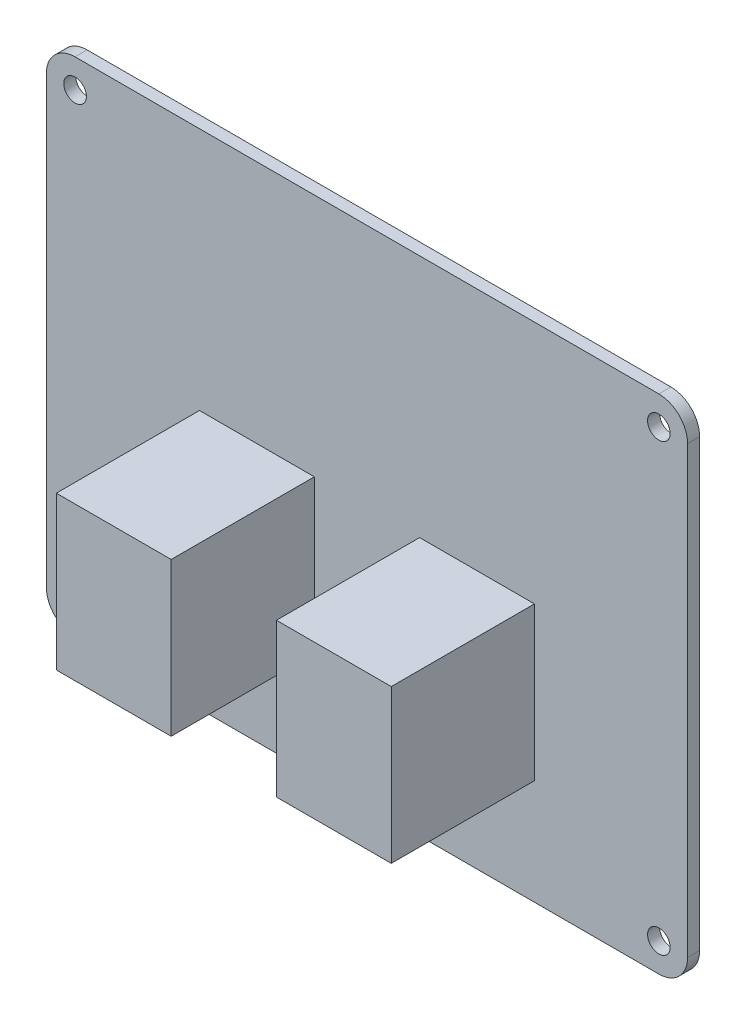
ISO-10303-21;
HEADER;
FILE_DESCRIPTION(('STEP AP214'),'2;1');
FILE_NAME('part.step','',(''),(''),'','','');
FILE_SCHEMA(('AUTOMOTIVE_DESIGN { 1 0 10303 214 1 1 1 1 }'));
ENDSEC;
DATA;
#1=APPLICATION_CONTEXT('core data for automotive mechanical design processes');
#2=APPLICATION_PROTOCOL_DEFINITION('international standard','automotive_design',2000,#1);
#3=PRODUCT_CONTEXT('',#1,'mechanical');
#4=PRODUCT('Part','Part','',(#3));
#5=PRODUCT_RELATED_PRODUCT_CATEGORY('part','',(#4));
#6=PRODUCT_DEFINITION_FORMATION('','',#4);
#7=PRODUCT_DEFINITION_CONTEXT('part definition',#1,'design');
#8=PRODUCT_DEFINITION('design','',#6,#7);
#9=PRODUCT_DEFINITION_SHAPE('','',#8);
#10=(LENGTH_UNIT() NAMED_UNIT(*) SI_UNIT(.MILLI.,.METRE.));
#11=(NAMED_UNIT(*) PLANE_ANGLE_UNIT() SI_UNIT($,.RADIAN.));
#12=(NAMED_UNIT(*) SI_UNIT($,.STERADIAN.) SOLID_ANGLE_UNIT());
#13=UNCERTAINTY_MEASURE_WITH_UNIT(LENGTH_MEASURE(1.E-05),#10,'distance_accuracy_value','');
#14=(GEOMETRIC_REPRESENTATION_CONTEXT(3) GLOBAL_UNCERTAINTY_ASSIGNED_CONTEXT((#13)) GLOBAL_UNIT_ASSIGNED_CONTEXT((#10,
#11,#12)) REPRESENTATION_CONTEXT('',''));
#15=CARTESIAN_POINT('',(0.,0.,0.));
#16=DIRECTION('',(0.,0.,1.));
#17=DIRECTION('',(1.,0.,0.));
#18=AXIS2_PLACEMENT_3D('',#15,#16,#17);
#19=CARTESIAN_POINT('',(0.,0.,1.6));
#20=DIRECTION('',(0.,0.,1.));
#21=DIRECTION('',(1.,0.,0.));
#22=AXIS2_PLACEMENT_3D('',#19,#20,#21);
#23=PLANE('',#22);
#24=CARTESIAN_POINT('',(3.81,62.865,1.6));
#25=DIRECTION('',(0.,0.,1.));
#26=DIRECTION('',(1.,0.,0.));
#27=AXIS2_PLACEMENT_3D('',#24,#25,#26);
#28=CIRCLE('',#27,1.49999999999999);
#29=CARTESIAN_POINT('',(5.30999999999999,62.865,1.6));
#30=VERTEX_POINT('',#29);
#31=EDGE_CURVE('E550',#30,#30,#28,.T.);
#32=ORIENTED_EDGE('',*,*,#31,.F.);
#33=EDGE_LOOP('',(#32));
#34=FACE_BOUND('',#33,.T.);
#35=CARTESIAN_POINT('',(3.81,3.81,1.6));
#36=DIRECTION('',(0.,0.,1.));
#37=DIRECTION('',(1.,0.,0.));
#38=AXIS2_PLACEMENT_3D('',#35,#36,#37);
#39=CIRCLE('',#38,1.49999999999999);
#40=CARTESIAN_POINT('',(5.30999999999999,3.81,1.6));
#41=VERTEX_POINT('',#40);
#42=EDGE_CURVE('E546',#41,#41,#39,.T.);
#43=ORIENTED_EDGE('',*,*,#42,.F.);
#44=EDGE_LOOP('',(#43));
#45=FACE_BOUND('',#44,.T.);
#46=CARTESIAN_POINT('',(81.28,3.81,1.6));
#47=DIRECTION('',(0.,0.,1.));
#48=DIRECTION('',(1.,0.,0.));
#49=AXIS2_PLACEMENT_3D('',#46,#47,#48);
#50=CIRCLE('',#49,1.49999999999999);
#51=CARTESIAN_POINT('',(82.78,3.81,1.6));
#52=VERTEX_POINT('',#51);
#53=EDGE_CURVE('E525',#52,#52,#50,.T.);
#54=ORIENTED_EDGE('',*,*,#53,.F.);
#55=EDGE_LOOP('',(#54));
#56=FACE_BOUND('',#55,.T.);
#57=CARTESIAN_POINT('',(81.28,62.865,1.6));
#58=DIRECTION('',(0.,0.,1.));
#59=DIRECTION('',(1.,0.,0.));
#60=AXIS2_PLACEMENT_3D('',#57,#58,#59);
#61=CIRCLE('',#60,1.49999999999999);
#62=CARTESIAN_POINT('',(82.78,62.865,1.6));
#63=VERTEX_POINT('',#62);
#64=EDGE_CURVE('E229',#63,#63,#61,.T.);
#65=ORIENTED_EDGE('',*,*,#64,.F.);
#66=EDGE_LOOP('',(#65));
#67=FACE_BOUND('',#66,.T.);
#68=DIRECTION('',(1.,0.,0.));
#69=VECTOR('',#68,1.);
#70=CARTESIAN_POINT('',(0.,0.,1.6));
#71=LINE('',#70,#69);
#72=CARTESIAN_POINT('',(3.81,0.,1.6));
#73=VERTEX_POINT('',#72);
#74=CARTESIAN_POINT('',(81.28,0.,1.6));
#75=VERTEX_POINT('',#74);
#76=EDGE_CURVE('E205',#73,#75,#71,.T.);
#77=ORIENTED_EDGE('',*,*,#76,.T.);
#78=CARTESIAN_POINT('',(81.28,3.81,1.6));
#79=DIRECTION('',(0.,0.,1.));
#80=DIRECTION('',(1.,0.,0.));
#81=AXIS2_PLACEMENT_3D('',#78,#79,#80);
#82=CIRCLE('',#81,3.81);
#83=CARTESIAN_POINT('',(85.09,3.81,1.6));
#84=VERTEX_POINT('',#83);
#85=EDGE_CURVE('E243',#75,#84,#82,.T.);
#86=ORIENTED_EDGE('',*,*,#85,.T.);
#87=DIRECTION('',(0.,1.,0.));
#88=VECTOR('',#87,1.);
#89=CARTESIAN_POINT('',(85.09,0.,1.6));
#90=LINE('',#89,#88);
#91=CARTESIAN_POINT('',(85.09,62.865,1.6));
#92=VERTEX_POINT('',#91);
#93=EDGE_CURVE('E221',#84,#92,#90,.T.);
#94=ORIENTED_EDGE('',*,*,#93,.T.);
#95=CARTESIAN_POINT('',(81.28,62.865,1.6));
#96=DIRECTION('',(0.,0.,1.));
#97=DIRECTION('',(1.,0.,0.));
#98=AXIS2_PLACEMENT_3D('',#95,#96,#97);
#99=CIRCLE('',#98,3.81);
#100=CARTESIAN_POINT('',(81.28,66.675,1.6));
#101=VERTEX_POINT('',#100);
#102=EDGE_CURVE('E239',#92,#101,#99,.T.);
#103=ORIENTED_EDGE('',*,*,#102,.T.);
#104=DIRECTION('',(-1.,0.,0.));
#105=VECTOR('',#104,1.);
#106=CARTESIAN_POINT('',(85.09,66.675,1.6));
#107=LINE('',#106,#105);
#108=CARTESIAN_POINT('',(3.81000000000001,66.675,1.6));
#109=VERTEX_POINT('',#108);
#110=EDGE_CURVE('E224',#101,#109,#107,.T.);
#111=ORIENTED_EDGE('',*,*,#110,.T.);
#112=CARTESIAN_POINT('',(3.81000000000001,62.865,1.6));
#113=DIRECTION('',(0.,0.,1.));
#114=DIRECTION('',(1.,0.,0.));
#115=AXIS2_PLACEMENT_3D('',#112,#113,#114);
#116=CIRCLE('',#115,3.81);
#117=CARTESIAN_POINT('',(0.,62.865,1.6));
#118=VERTEX_POINT('',#117);
#119=EDGE_CURVE('E237',#109,#118,#116,.T.);
#120=ORIENTED_EDGE('',*,*,#119,.T.);
#121=DIRECTION('',(0.,-1.,0.));
#122=VECTOR('',#121,1.);
#123=CARTESIAN_POINT('',(0.,66.675,1.6));
#124=LINE('',#123,#122);
#125=CARTESIAN_POINT('',(0.,3.80999999999999,1.6));
#126=VERTEX_POINT('',#125);
#127=EDGE_CURVE('E210',#118,#126,#124,.T.);
#128=ORIENTED_EDGE('',*,*,#127,.T.);
#129=CARTESIAN_POINT('',(3.81,3.80999999999999,1.6));
#130=DIRECTION('',(0.,0.,1.));
#131=DIRECTION('',(1.,0.,0.));
#132=AXIS2_PLACEMENT_3D('',#129,#130,#131);
#133=CIRCLE('',#132,3.81);
#134=EDGE_CURVE('E241',#126,#73,#133,.T.);
#135=ORIENTED_EDGE('',*,*,#134,.T.);
#136=EDGE_LOOP('',(#77,#86,#94,#103,#111,#120,#128,#135));
#137=FACE_BOUND('',#136,.T.);
#138=DIRECTION('',(1.,0.,0.));
#139=VECTOR('',#138,1.);
#140=CARTESIAN_POINT('',(64.77,13.97,1.6));
#141=LINE('',#140,#139);
#142=CARTESIAN_POINT('',(49.53,13.97,1.6));
#143=VERTEX_POINT('',#142);
#144=CARTESIAN_POINT('',(64.77,13.97,1.6));
#145=VERTEX_POINT('',#144);
#146=EDGE_CURVE('E174',#143,#145,#141,.T.);
#147=ORIENTED_EDGE('',*,*,#146,.F.);
#148=DIRECTION('',(0.,-1.,0.));
#149=VECTOR('',#148,1.);
#150=CARTESIAN_POINT('',(49.53,13.97,1.6));
#151=LINE('',#150,#149);
#152=CARTESIAN_POINT('',(49.53,34.29,1.6));
#153=VERTEX_POINT('',#152);
#154=EDGE_CURVE('E171',#153,#143,#151,.T.);
#155=ORIENTED_EDGE('',*,*,#154,.F.);
#156=DIRECTION('',(-1.,0.,0.));
#157=VECTOR('',#156,1.);
#158=CARTESIAN_POINT('',(49.53,34.29,1.6));
#159=LINE('',#158,#157);
#160=CARTESIAN_POINT('',(64.77,34.29,1.6));
#161=VERTEX_POINT('',#160);
#162=EDGE_CURVE('E184',#161,#153,#159,.T.);
#163=ORIENTED_EDGE('',*,*,#162,.F.);
#164=DIRECTION('',(0.,1.,0.));
#165=VECTOR('',#164,1.);
#166=CARTESIAN_POINT('',(64.77,34.29,1.6));
#167=LINE('',#166,#165);
#168=EDGE_CURVE('E192',#145,#161,#167,.T.);
#169=ORIENTED_EDGE('',*,*,#168,.F.);
#170=EDGE_LOOP('',(#147,#155,#163,#169));
#171=FACE_BOUND('',#170,.T.);
#172=DIRECTION('',(-1.,0.,0.));
#173=VECTOR('',#172,1.);
#174=CARTESIAN_POINT('',(20.32,34.29,1.6));
#175=LINE('',#174,#173);
#176=CARTESIAN_POINT('',(35.56,34.29,1.6));
#177=VERTEX_POINT('',#176);
#178=CARTESIAN_POINT('',(20.32,34.29,1.6));
#179=VERTEX_POINT('',#178);
#180=EDGE_CURVE('E535',#177,#179,#175,.T.);
#181=ORIENTED_EDGE('',*,*,#180,.F.);
#182=DIRECTION('',(0.,1.,0.));
#183=VECTOR('',#182,1.);
#184=CARTESIAN_POINT('',(35.56,34.29,1.6));
#185=LINE('',#184,#183);
#186=CARTESIAN_POINT('',(35.56,13.97,1.6));
#187=VERTEX_POINT('',#186);
#188=EDGE_CURVE('E169',#187,#177,#185,.T.);
#189=ORIENTED_EDGE('',*,*,#188,.F.);
#190=DIRECTION('',(1.,0.,0.));
#191=VECTOR('',#190,1.);
#192=CARTESIAN_POINT('',(35.56,13.97,1.6));
#193=LINE('',#192,#191);
#194=CARTESIAN_POINT('',(20.32,13.97,1.6));
#195=VERTEX_POINT('',#194);
#196=EDGE_CURVE('E165',#195,#187,#193,.T.);
#197=ORIENTED_EDGE('',*,*,#196,.F.);
#198=DIRECTION('',(0.,-1.,0.));
#199=VECTOR('',#198,1.);
#200=CARTESIAN_POINT('',(20.32,13.97,1.6));
#201=LINE('',#200,#199);
#202=EDGE_CURVE('E537',#179,#195,#201,.T.);
#203=ORIENTED_EDGE('',*,*,#202,.F.);
#204=EDGE_LOOP('',(#181,#189,#197,#203));
#205=FACE_BOUND('',#204,.T.);
#206=ADVANCED_FACE('F33',(#34,#45,#56,#67,#137,#171,#205),#23,.T.);
#207=CARTESIAN_POINT('',(0.,0.,0.));
#208=DIRECTION('',(0.,-1.,0.));
#209=DIRECTION('',(0.,0.,-1.));
#210=AXIS2_PLACEMENT_3D('',#207,#208,#209);
#211=PLANE('',#210);
#212=DIRECTION('',(1.,0.,0.));
#213=VECTOR('',#212,1.);
#214=CARTESIAN_POINT('',(0.,0.,0.));
#215=LINE('',#214,#213);
#216=CARTESIAN_POINT('',(3.81,0.,0.));
#217=VERTEX_POINT('',#216);
#218=CARTESIAN_POINT('',(81.28,0.,0.));
#219=VERTEX_POINT('',#218);
#220=EDGE_CURVE('E206',#217,#219,#215,.T.);
#221=ORIENTED_EDGE('',*,*,#220,.T.);
#222=DIRECTION('',(0.,0.,1.));
#223=VECTOR('',#222,1.);
#224=CARTESIAN_POINT('',(81.28,0.,0.));
#225=LINE('',#224,#223);
#226=EDGE_CURVE('E234',#219,#75,#225,.T.);
#227=ORIENTED_EDGE('',*,*,#226,.T.);
#228=ORIENTED_EDGE('',*,*,#76,.F.);
#229=DIRECTION('',(0.,0.,1.));
#230=VECTOR('',#229,1.);
#231=CARTESIAN_POINT('',(3.81,0.,0.));
#232=LINE('',#231,#230);
#233=EDGE_CURVE('E218',#73,#217,#232,.F.);
#234=ORIENTED_EDGE('',*,*,#233,.T.);
#235=EDGE_LOOP('',(#221,#227,#228,#234));
#236=FACE_BOUND('',#235,.T.);
#237=ADVANCED_FACE('F285',(#236),#211,.T.);
#238=CARTESIAN_POINT('',(0.,66.675,0.));
#239=DIRECTION('',(-1.,0.,0.));
#240=DIRECTION('',(0.,0.,1.));
#241=AXIS2_PLACEMENT_3D('',#238,#239,#240);
#242=PLANE('',#241);
#243=DIRECTION('',(0.,-1.,0.));
#244=VECTOR('',#243,1.);
#245=CARTESIAN_POINT('',(0.,66.675,0.));
#246=LINE('',#245,#244);
#247=CARTESIAN_POINT('',(0.,62.865,0.));
#248=VERTEX_POINT('',#247);
#249=CARTESIAN_POINT('',(0.,3.80999999999999,0.));
#250=VERTEX_POINT('',#249);
#251=EDGE_CURVE('E215',#248,#250,#246,.T.);
#252=ORIENTED_EDGE('',*,*,#251,.T.);
#253=DIRECTION('',(0.,0.,1.));
#254=VECTOR('',#253,1.);
#255=CARTESIAN_POINT('',(0.,3.80999999999999,0.));
#256=LINE('',#255,#254);
#257=EDGE_CURVE('E259',#250,#126,#256,.T.);
#258=ORIENTED_EDGE('',*,*,#257,.T.);
#259=ORIENTED_EDGE('',*,*,#127,.F.);
#260=DIRECTION('',(0.,0.,1.));
#261=VECTOR('',#260,1.);
#262=CARTESIAN_POINT('',(0.,62.865,0.));
#263=LINE('',#262,#261);
#264=EDGE_CURVE('E257',#118,#248,#263,.F.);
#265=ORIENTED_EDGE('',*,*,#264,.T.);
#266=EDGE_LOOP('',(#252,#258,#259,#265));
#267=FACE_BOUND('',#266,.T.);
#268=ADVANCED_FACE('F292',(#267),#242,.T.);
#269=CARTESIAN_POINT('',(85.09,66.675,0.));
#270=DIRECTION('',(0.,1.,0.));
#271=DIRECTION('',(0.,0.,1.));
#272=AXIS2_PLACEMENT_3D('',#269,#270,#271);
#273=PLANE('',#272);
#274=ORIENTED_EDGE('',*,*,#110,.F.);
#275=DIRECTION('',(0.,0.,1.));
#276=VECTOR('',#275,1.);
#277=CARTESIAN_POINT('',(81.28,66.675,0.));
#278=LINE('',#277,#276);
#279=CARTESIAN_POINT('',(81.28,66.675,0.));
#280=VERTEX_POINT('',#279);
#281=EDGE_CURVE('E11',#101,#280,#278,.F.);
#282=ORIENTED_EDGE('',*,*,#281,.T.);
#283=DIRECTION('',(-1.,0.,0.));
#284=VECTOR('',#283,1.);
#285=CARTESIAN_POINT('',(85.09,66.675,0.));
#286=LINE('',#285,#284);
#287=CARTESIAN_POINT('',(3.81000000000001,66.675,0.));
#288=VERTEX_POINT('',#287);
#289=EDGE_CURVE('E213',#280,#288,#286,.T.);
#290=ORIENTED_EDGE('',*,*,#289,.T.);
#291=DIRECTION('',(0.,0.,1.));
#292=VECTOR('',#291,1.);
#293=CARTESIAN_POINT('',(3.81000000000001,66.675,0.));
#294=LINE('',#293,#292);
#295=EDGE_CURVE('E41',#288,#109,#294,.T.);
#296=ORIENTED_EDGE('',*,*,#295,.T.);
#297=EDGE_LOOP('',(#274,#282,#290,#296));
#298=FACE_BOUND('',#297,.T.);
#299=ADVANCED_FACE('F263',(#298),#273,.T.);
#300=CARTESIAN_POINT('',(85.09,0.,0.));
#301=DIRECTION('',(1.,0.,0.));
#302=DIRECTION('',(0.,0.,-1.));
#303=AXIS2_PLACEMENT_3D('',#300,#301,#302);
#304=PLANE('',#303);
#305=ORIENTED_EDGE('',*,*,#93,.F.);
#306=DIRECTION('',(0.,0.,1.));
#307=VECTOR('',#306,1.);
#308=CARTESIAN_POINT('',(85.09,3.81,0.));
#309=LINE('',#308,#307);
#310=CARTESIAN_POINT('',(85.09,3.81,0.));
#311=VERTEX_POINT('',#310);
#312=EDGE_CURVE('E248',#84,#311,#309,.F.);
#313=ORIENTED_EDGE('',*,*,#312,.T.);
#314=DIRECTION('',(0.,1.,0.));
#315=VECTOR('',#314,1.);
#316=CARTESIAN_POINT('',(85.09,0.,0.));
#317=LINE('',#316,#315);
#318=CARTESIAN_POINT('',(85.09,62.865,0.));
#319=VERTEX_POINT('',#318);
#320=EDGE_CURVE('E209',#311,#319,#317,.T.);
#321=ORIENTED_EDGE('',*,*,#320,.T.);
#322=DIRECTION('',(0.,0.,1.));
#323=VECTOR('',#322,1.);
#324=CARTESIAN_POINT('',(85.09,62.865,0.));
#325=LINE('',#324,#323);
#326=EDGE_CURVE('E245',#319,#92,#325,.T.);
#327=ORIENTED_EDGE('',*,*,#326,.T.);
#328=EDGE_LOOP('',(#305,#313,#321,#327));
#329=FACE_BOUND('',#328,.T.);
#330=ADVANCED_FACE('F274',(#329),#304,.T.);
#331=CARTESIAN_POINT('',(0.,0.,0.));
#332=DIRECTION('',(0.,0.,1.));
#333=DIRECTION('',(1.,0.,0.));
#334=AXIS2_PLACEMENT_3D('',#331,#332,#333);
#335=PLANE('',#334);
#336=CARTESIAN_POINT('',(3.81,62.865,0.));
#337=DIRECTION('',(0.,0.,-1.));
#338=DIRECTION('',(-1.,0.,0.));
#339=AXIS2_PLACEMENT_3D('',#336,#337,#338);
#340=CIRCLE('',#339,1.49999999999999);
#341=CARTESIAN_POINT('',(2.31000000000001,62.865,0.));
#342=VERTEX_POINT('',#341);
#343=EDGE_CURVE('E513',#342,#342,#340,.T.);
#344=ORIENTED_EDGE('',*,*,#343,.F.);
#345=EDGE_LOOP('',(#344));
#346=FACE_BOUND('',#345,.T.);
#347=CARTESIAN_POINT('',(3.81,3.81,0.));
#348=DIRECTION('',(0.,0.,-1.));
#349=DIRECTION('',(-1.,0.,0.));
#350=AXIS2_PLACEMENT_3D('',#347,#348,#349);
#351=CIRCLE('',#350,1.49999999999999);
#352=CARTESIAN_POINT('',(2.31000000000001,3.81,0.));
#353=VERTEX_POINT('',#352);
#354=EDGE_CURVE('E517',#353,#353,#351,.T.);
#355=ORIENTED_EDGE('',*,*,#354,.F.);
#356=EDGE_LOOP('',(#355));
#357=FACE_BOUND('',#356,.T.);
#358=CARTESIAN_POINT('',(81.28,3.81,0.));
#359=DIRECTION('',(0.,0.,-1.));
#360=DIRECTION('',(-1.,0.,0.));
#361=AXIS2_PLACEMENT_3D('',#358,#359,#360);
#362=CIRCLE('',#361,1.49999999999999);
#363=CARTESIAN_POINT('',(79.78,3.81,0.));
#364=VERTEX_POINT('',#363);
#365=EDGE_CURVE('E521',#364,#364,#362,.T.);
#366=ORIENTED_EDGE('',*,*,#365,.F.);
#367=EDGE_LOOP('',(#366));
#368=FACE_BOUND('',#367,.T.);
#369=CARTESIAN_POINT('',(81.28,62.865,0.));
#370=DIRECTION('',(0.,0.,-1.));
#371=DIRECTION('',(-1.,0.,0.));
#372=AXIS2_PLACEMENT_3D('',#369,#370,#371);
#373=CIRCLE('',#372,1.49999999999999);
#374=CARTESIAN_POINT('',(79.78,62.865,0.));
#375=VERTEX_POINT('',#374);
#376=EDGE_CURVE('E232',#375,#375,#373,.T.);
#377=ORIENTED_EDGE('',*,*,#376,.F.);
#378=EDGE_LOOP('',(#377));
#379=FACE_BOUND('',#378,.T.);
#380=ORIENTED_EDGE('',*,*,#320,.F.);
#381=CARTESIAN_POINT('',(81.28,3.81,0.));
#382=DIRECTION('',(0.,0.,1.));
#383=DIRECTION('',(1.,0.,0.));
#384=AXIS2_PLACEMENT_3D('',#381,#382,#383);
#385=CIRCLE('',#384,3.81);
#386=EDGE_CURVE('E255',#311,#219,#385,.F.);
#387=ORIENTED_EDGE('',*,*,#386,.T.);
#388=ORIENTED_EDGE('',*,*,#220,.F.);
#389=CARTESIAN_POINT('',(3.81,3.80999999999999,0.));
#390=DIRECTION('',(0.,0.,1.));
#391=DIRECTION('',(1.,0.,0.));
#392=AXIS2_PLACEMENT_3D('',#389,#390,#391);
#393=CIRCLE('',#392,3.81);
#394=EDGE_CURVE('E253',#217,#250,#393,.F.);
#395=ORIENTED_EDGE('',*,*,#394,.T.);
#396=ORIENTED_EDGE('',*,*,#251,.F.);
#397=CARTESIAN_POINT('',(3.81000000000001,62.865,0.));
#398=DIRECTION('',(0.,0.,1.));
#399=DIRECTION('',(1.,0.,0.));
#400=AXIS2_PLACEMENT_3D('',#397,#398,#399);
#401=CIRCLE('',#400,3.81);
#402=EDGE_CURVE('E48',#248,#288,#401,.F.);
#403=ORIENTED_EDGE('',*,*,#402,.T.);
#404=ORIENTED_EDGE('',*,*,#289,.F.);
#405=CARTESIAN_POINT('',(81.28,62.865,0.));
#406=DIRECTION('',(0.,0.,1.));
#407=DIRECTION('',(1.,0.,0.));
#408=AXIS2_PLACEMENT_3D('',#405,#406,#407);
#409=CIRCLE('',#408,3.81);
#410=EDGE_CURVE('E251',#280,#319,#409,.F.);
#411=ORIENTED_EDGE('',*,*,#410,.T.);
#412=EDGE_LOOP('',(#380,#387,#388,#395,#396,#403,#404,#411));
#413=FACE_BOUND('',#412,.T.);
#414=ADVANCED_FACE('F278',(#346,#357,#368,#379,#413),#335,.F.);
#415=CARTESIAN_POINT('',(49.53,13.97,20.6));
#416=DIRECTION('',(1.,0.,0.));
#417=DIRECTION('',(0.,0.,-1.));
#418=AXIS2_PLACEMENT_3D('',#415,#416,#417);
#419=PLANE('',#418);
#420=ORIENTED_EDGE('',*,*,#154,.T.);
#421=DIRECTION('',(0.,0.,-1.));
#422=VECTOR('',#421,1.);
#423=CARTESIAN_POINT('',(49.53,13.97,20.6));
#424=LINE('',#423,#422);
#425=CARTESIAN_POINT('',(49.53,13.97,20.6));
#426=VERTEX_POINT('',#425);
#427=EDGE_CURVE('E203',#426,#143,#424,.T.);
#428=ORIENTED_EDGE('',*,*,#427,.F.);
#429=DIRECTION('',(0.,-1.,0.));
#430=VECTOR('',#429,1.);
#431=CARTESIAN_POINT('',(49.53,13.97,20.6));
#432=LINE('',#431,#430);
#433=CARTESIAN_POINT('',(49.53,34.29,20.6));
#434=VERTEX_POINT('',#433);
#435=EDGE_CURVE('E180',#434,#426,#432,.T.);
#436=ORIENTED_EDGE('',*,*,#435,.F.);
#437=DIRECTION('',(0.,0.,-1.));
#438=VECTOR('',#437,1.);
#439=CARTESIAN_POINT('',(49.53,34.29,20.6));
#440=LINE('',#439,#438);
#441=EDGE_CURVE('E189',#434,#153,#440,.T.);
#442=ORIENTED_EDGE('',*,*,#441,.T.);
#443=EDGE_LOOP('',(#420,#428,#436,#442));
#444=FACE_BOUND('',#443,.T.);
#445=ADVANCED_FACE('F456',(#444),#419,.F.);
#446=CARTESIAN_POINT('',(64.77,13.97,20.6));
#447=DIRECTION('',(0.,1.,0.));
#448=DIRECTION('',(0.,0.,1.));
#449=AXIS2_PLACEMENT_3D('',#446,#447,#448);
#450=PLANE('',#449);
#451=ORIENTED_EDGE('',*,*,#146,.T.);
#452=DIRECTION('',(0.,0.,-1.));
#453=VECTOR('',#452,1.);
#454=CARTESIAN_POINT('',(64.77,13.97,20.6));
#455=LINE('',#454,#453);
#456=CARTESIAN_POINT('',(64.77,13.97,20.6));
#457=VERTEX_POINT('',#456);
#458=EDGE_CURVE('E200',#457,#145,#455,.T.);
#459=ORIENTED_EDGE('',*,*,#458,.F.);
#460=DIRECTION('',(1.,0.,0.));
#461=VECTOR('',#460,1.);
#462=CARTESIAN_POINT('',(64.77,13.97,20.6));
#463=LINE('',#462,#461);
#464=EDGE_CURVE('E183',#426,#457,#463,.T.);
#465=ORIENTED_EDGE('',*,*,#464,.F.);
#466=ORIENTED_EDGE('',*,*,#427,.T.);
#467=EDGE_LOOP('',(#451,#459,#465,#466));
#468=FACE_BOUND('',#467,.T.);
#469=ADVANCED_FACE('F447',(#468),#450,.F.);
#470=CARTESIAN_POINT('',(64.77,34.29,20.6));
#471=DIRECTION('',(-1.,0.,0.));
#472=DIRECTION('',(0.,0.,1.));
#473=AXIS2_PLACEMENT_3D('',#470,#471,#472);
#474=PLANE('',#473);
#475=ORIENTED_EDGE('',*,*,#168,.T.);
#476=DIRECTION('',(0.,0.,-1.));
#477=VECTOR('',#476,1.);
#478=CARTESIAN_POINT('',(64.77,34.29,20.6));
#479=LINE('',#478,#477);
#480=CARTESIAN_POINT('',(64.77,34.29,20.6));
#481=VERTEX_POINT('',#480);
#482=EDGE_CURVE('E198',#481,#161,#479,.T.);
#483=ORIENTED_EDGE('',*,*,#482,.F.);
#484=DIRECTION('',(0.,1.,0.));
#485=VECTOR('',#484,1.);
#486=CARTESIAN_POINT('',(64.77,34.29,20.6));
#487=LINE('',#486,#485);
#488=EDGE_CURVE('E186',#457,#481,#487,.T.);
#489=ORIENTED_EDGE('',*,*,#488,.F.);
#490=ORIENTED_EDGE('',*,*,#458,.T.);
#491=EDGE_LOOP('',(#475,#483,#489,#490));
#492=FACE_BOUND('',#491,.T.);
#493=ADVANCED_FACE('F438',(#492),#474,.F.);
#494=CARTESIAN_POINT('',(49.53,34.29,20.6));
#495=DIRECTION('',(0.,-1.,0.));
#496=DIRECTION('',(0.,0.,-1.));
#497=AXIS2_PLACEMENT_3D('',#494,#495,#496);
#498=PLANE('',#497);
#499=ORIENTED_EDGE('',*,*,#162,.T.);
#500=ORIENTED_EDGE('',*,*,#441,.F.);
#501=DIRECTION('',(-1.,0.,0.));
#502=VECTOR('',#501,1.);
#503=CARTESIAN_POINT('',(49.53,34.29,20.6));
#504=LINE('',#503,#502);
#505=EDGE_CURVE('E188',#481,#434,#504,.T.);
#506=ORIENTED_EDGE('',*,*,#505,.F.);
#507=ORIENTED_EDGE('',*,*,#482,.T.);
#508=EDGE_LOOP('',(#499,#500,#506,#507));
#509=FACE_BOUND('',#508,.T.);
#510=ADVANCED_FACE('F429',(#509),#498,.F.);
#511=CARTESIAN_POINT('',(0.,0.,20.6));
#512=DIRECTION('',(0.,0.,-1.));
#513=DIRECTION('',(-1.,0.,0.));
#514=AXIS2_PLACEMENT_3D('',#511,#512,#513);
#515=PLANE('',#514);
#516=ORIENTED_EDGE('',*,*,#435,.T.);
#517=ORIENTED_EDGE('',*,*,#464,.T.);
#518=ORIENTED_EDGE('',*,*,#488,.T.);
#519=ORIENTED_EDGE('',*,*,#505,.T.);
#520=EDGE_LOOP('',(#516,#517,#518,#519));
#521=FACE_BOUND('',#520,.T.);
#522=ADVANCED_FACE('F416',(#521),#515,.F.);
#523=CARTESIAN_POINT('',(35.56,34.29,20.6));
#524=DIRECTION('',(-1.,0.,0.));
#525=DIRECTION('',(0.,0.,1.));
#526=AXIS2_PLACEMENT_3D('',#523,#524,#525);
#527=PLANE('',#526);
#528=ORIENTED_EDGE('',*,*,#188,.T.);
#529=DIRECTION('',(0.,0.,-1.));
#530=VECTOR('',#529,1.);
#531=CARTESIAN_POINT('',(35.56,34.29,20.6));
#532=LINE('',#531,#530);
#533=CARTESIAN_POINT('',(35.56,34.29,20.6));
#534=VERTEX_POINT('',#533);
#535=EDGE_CURVE('E149',#534,#177,#532,.T.);
#536=ORIENTED_EDGE('',*,*,#535,.F.);
#537=DIRECTION('',(0.,1.,0.));
#538=VECTOR('',#537,1.);
#539=CARTESIAN_POINT('',(35.56,34.29,20.6));
#540=LINE('',#539,#538);
#541=CARTESIAN_POINT('',(35.56,13.97,20.6));
#542=VERTEX_POINT('',#541);
#543=EDGE_CURVE('E156',#542,#534,#540,.T.);
#544=ORIENTED_EDGE('',*,*,#543,.F.);
#545=DIRECTION('',(0.,0.,-1.));
#546=VECTOR('',#545,1.);
#547=CARTESIAN_POINT('',(35.56,13.97,20.6));
#548=LINE('',#547,#546);
#549=EDGE_CURVE('E533',#542,#187,#548,.T.);
#550=ORIENTED_EDGE('',*,*,#549,.T.);
#551=EDGE_LOOP('',(#528,#536,#544,#550));
#552=FACE_BOUND('',#551,.T.);
#553=ADVANCED_FACE('F167',(#552),#527,.F.);
#554=CARTESIAN_POINT('',(20.32,34.29,20.6));
#555=DIRECTION('',(0.,-1.,0.));
#556=DIRECTION('',(0.,0.,-1.));
#557=AXIS2_PLACEMENT_3D('',#554,#555,#556);
#558=PLANE('',#557);
#559=ORIENTED_EDGE('',*,*,#180,.T.);
#560=DIRECTION('',(0.,0.,-1.));
#561=VECTOR('',#560,1.);
#562=CARTESIAN_POINT('',(20.32,34.29,20.6));
#563=LINE('',#562,#561);
#564=CARTESIAN_POINT('',(20.32,34.29,20.6));
#565=VERTEX_POINT('',#564);
#566=EDGE_CURVE('E152',#565,#179,#563,.T.);
#567=ORIENTED_EDGE('',*,*,#566,.F.);
#568=DIRECTION('',(-1.,0.,0.));
#569=VECTOR('',#568,1.);
#570=CARTESIAN_POINT('',(20.32,34.29,20.6));
#571=LINE('',#570,#569);
#572=EDGE_CURVE('E145',#534,#565,#571,.T.);
#573=ORIENTED_EDGE('',*,*,#572,.F.);
#574=ORIENTED_EDGE('',*,*,#535,.T.);
#575=EDGE_LOOP('',(#559,#567,#573,#574));
#576=FACE_BOUND('',#575,.T.);
#577=ADVANCED_FACE('F147',(#576),#558,.F.);
#578=CARTESIAN_POINT('',(20.32,13.97,20.6));
#579=DIRECTION('',(1.,0.,0.));
#580=DIRECTION('',(0.,0.,-1.));
#581=AXIS2_PLACEMENT_3D('',#578,#579,#580);
#582=PLANE('',#581);
#583=ORIENTED_EDGE('',*,*,#202,.T.);
#584=DIRECTION('',(0.,0.,-1.));
#585=VECTOR('',#584,1.);
#586=CARTESIAN_POINT('',(20.32,13.97,20.6));
#587=LINE('',#586,#585);
#588=CARTESIAN_POINT('',(20.32,13.97,20.6));
#589=VERTEX_POINT('',#588);
#590=EDGE_CURVE('E176',#589,#195,#587,.T.);
#591=ORIENTED_EDGE('',*,*,#590,.F.);
#592=DIRECTION('',(0.,-1.,0.));
#593=VECTOR('',#592,1.);
#594=CARTESIAN_POINT('',(20.32,13.97,20.6));
#595=LINE('',#594,#593);
#596=EDGE_CURVE('E155',#565,#589,#595,.T.);
#597=ORIENTED_EDGE('',*,*,#596,.F.);
#598=ORIENTED_EDGE('',*,*,#566,.T.);
#599=EDGE_LOOP('',(#583,#591,#597,#598));
#600=FACE_BOUND('',#599,.T.);
#601=ADVANCED_FACE('F392',(#600),#582,.F.);
#602=CARTESIAN_POINT('',(35.56,13.97,20.6));
#603=DIRECTION('',(0.,1.,0.));
#604=DIRECTION('',(0.,0.,1.));
#605=AXIS2_PLACEMENT_3D('',#602,#603,#604);
#606=PLANE('',#605);
#607=ORIENTED_EDGE('',*,*,#196,.T.);
#608=ORIENTED_EDGE('',*,*,#549,.F.);
#609=DIRECTION('',(1.,0.,0.));
#610=VECTOR('',#609,1.);
#611=CARTESIAN_POINT('',(35.56,13.97,20.6));
#612=LINE('',#611,#610);
#613=EDGE_CURVE('E161',#589,#542,#612,.T.);
#614=ORIENTED_EDGE('',*,*,#613,.F.);
#615=ORIENTED_EDGE('',*,*,#590,.T.);
#616=EDGE_LOOP('',(#607,#608,#614,#615));
#617=FACE_BOUND('',#616,.T.);
#618=ADVANCED_FACE('F384',(#617),#606,.F.);
#619=CARTESIAN_POINT('',(0.,0.,20.6));
#620=DIRECTION('',(0.,0.,-1.));
#621=DIRECTION('',(-1.,0.,0.));
#622=AXIS2_PLACEMENT_3D('',#619,#620,#621);
#623=PLANE('',#622);
#624=ORIENTED_EDGE('',*,*,#543,.T.);
#625=ORIENTED_EDGE('',*,*,#572,.T.);
#626=ORIENTED_EDGE('',*,*,#596,.T.);
#627=ORIENTED_EDGE('',*,*,#613,.T.);
#628=EDGE_LOOP('',(#624,#625,#626,#627));
#629=FACE_BOUND('',#628,.T.);
#630=ADVANCED_FACE('F159',(#629),#623,.F.);
#631=CARTESIAN_POINT('',(81.28,62.865,0.));
#632=DIRECTION('',(0.,0.,-1.));
#633=DIRECTION('',(-1.,0.,0.));
#634=AXIS2_PLACEMENT_3D('',#631,#632,#633);
#635=CYLINDRICAL_SURFACE('',#634,1.49999999999999);
#636=ORIENTED_EDGE('',*,*,#64,.T.);
#637=EDGE_LOOP('',(#636));
#638=FACE_BOUND('',#637,.T.);
#639=ORIENTED_EDGE('',*,*,#376,.T.);
#640=EDGE_LOOP('',(#639));
#641=FACE_BOUND('',#640,.T.);
#642=ADVANCED_FACE('F367',(#638,#641),#635,.F.);
#643=CARTESIAN_POINT('',(81.28,3.81,0.));
#644=DIRECTION('',(0.,0.,-1.));
#645=DIRECTION('',(-1.,0.,0.));
#646=AXIS2_PLACEMENT_3D('',#643,#644,#645);
#647=CYLINDRICAL_SURFACE('',#646,1.49999999999999);
#648=ORIENTED_EDGE('',*,*,#53,.T.);
#649=EDGE_LOOP('',(#648));
#650=FACE_BOUND('',#649,.T.);
#651=ORIENTED_EDGE('',*,*,#365,.T.);
#652=EDGE_LOOP('',(#651));
#653=FACE_BOUND('',#652,.T.);
#654=ADVANCED_FACE('F358',(#650,#653),#647,.F.);
#655=CARTESIAN_POINT('',(3.81,3.81,0.));
#656=DIRECTION('',(0.,0.,-1.));
#657=DIRECTION('',(-1.,0.,0.));
#658=AXIS2_PLACEMENT_3D('',#655,#656,#657);
#659=CYLINDRICAL_SURFACE('',#658,1.49999999999999);
#660=ORIENTED_EDGE('',*,*,#42,.T.);
#661=EDGE_LOOP('',(#660));
#662=FACE_BOUND('',#661,.T.);
#663=ORIENTED_EDGE('',*,*,#354,.T.);
#664=EDGE_LOOP('',(#663));
#665=FACE_BOUND('',#664,.T.);
#666=ADVANCED_FACE('F349',(#662,#665),#659,.F.);
#667=CARTESIAN_POINT('',(3.81,62.865,0.));
#668=DIRECTION('',(0.,0.,-1.));
#669=DIRECTION('',(-1.,0.,0.));
#670=AXIS2_PLACEMENT_3D('',#667,#668,#669);
#671=CYLINDRICAL_SURFACE('',#670,1.49999999999999);
#672=ORIENTED_EDGE('',*,*,#31,.T.);
#673=EDGE_LOOP('',(#672));
#674=FACE_BOUND('',#673,.T.);
#675=ORIENTED_EDGE('',*,*,#343,.T.);
#676=EDGE_LOOP('',(#675));
#677=FACE_BOUND('',#676,.T.);
#678=ADVANCED_FACE('F318',(#674,#677),#671,.F.);
#679=CARTESIAN_POINT('',(81.28,3.81,0.));
#680=DIRECTION('',(0.,0.,1.));
#681=DIRECTION('',(1.,0.,0.));
#682=AXIS2_PLACEMENT_3D('',#679,#680,#681);
#683=CYLINDRICAL_SURFACE('',#682,3.81);
#684=ORIENTED_EDGE('',*,*,#386,.F.);
#685=ORIENTED_EDGE('',*,*,#312,.F.);
#686=ORIENTED_EDGE('',*,*,#85,.F.);
#687=ORIENTED_EDGE('',*,*,#226,.F.);
#688=EDGE_LOOP('',(#684,#685,#686,#687));
#689=FACE_BOUND('',#688,.T.);
#690=ADVANCED_FACE('F282',(#689),#683,.T.);
#691=CARTESIAN_POINT('',(3.81,3.80999999999999,0.));
#692=DIRECTION('',(0.,0.,1.));
#693=DIRECTION('',(1.,0.,0.));
#694=AXIS2_PLACEMENT_3D('',#691,#692,#693);
#695=CYLINDRICAL_SURFACE('',#694,3.81);
#696=ORIENTED_EDGE('',*,*,#394,.F.);
#697=ORIENTED_EDGE('',*,*,#233,.F.);
#698=ORIENTED_EDGE('',*,*,#134,.F.);
#699=ORIENTED_EDGE('',*,*,#257,.F.);
#700=EDGE_LOOP('',(#696,#697,#698,#699));
#701=FACE_BOUND('',#700,.T.);
#702=ADVANCED_FACE('F290',(#701),#695,.T.);
#703=CARTESIAN_POINT('',(81.28,62.865,0.));
#704=DIRECTION('',(0.,0.,1.));
#705=DIRECTION('',(1.,0.,0.));
#706=AXIS2_PLACEMENT_3D('',#703,#704,#705);
#707=CYLINDRICAL_SURFACE('',#706,3.81);
#708=ORIENTED_EDGE('',*,*,#410,.F.);
#709=ORIENTED_EDGE('',*,*,#281,.F.);
#710=ORIENTED_EDGE('',*,*,#102,.F.);
#711=ORIENTED_EDGE('',*,*,#326,.F.);
#712=EDGE_LOOP('',(#708,#709,#710,#711));
#713=FACE_BOUND('',#712,.T.);
#714=ADVANCED_FACE('F272',(#713),#707,.T.);
#715=CARTESIAN_POINT('',(3.81000000000001,62.865,0.));
#716=DIRECTION('',(0.,0.,1.));
#717=DIRECTION('',(1.,0.,0.));
#718=AXIS2_PLACEMENT_3D('',#715,#716,#717);
#719=CYLINDRICAL_SURFACE('',#718,3.81);
#720=ORIENTED_EDGE('',*,*,#402,.F.);
#721=ORIENTED_EDGE('',*,*,#264,.F.);
#722=ORIENTED_EDGE('',*,*,#119,.F.);
#723=ORIENTED_EDGE('',*,*,#295,.F.);
#724=EDGE_LOOP('',(#720,#721,#722,#723));
#725=FACE_BOUND('',#724,.T.);
#726=ADVANCED_FACE('F35',(#725),#719,.T.);
#727=CLOSED_SHELL('',(#206,#237,#268,#299,#330,#414,#445,#469,#493,#510,#522,#553,#577,#601,
#618,#630,#642,#654,#666,#678,#690,#702,#714,#726));
#728=MANIFOLD_SOLID_BREP('B2',#727);
#729=ADVANCED_BREP_SHAPE_REPRESENTATION('',(#18,#728),#14);
#730=SHAPE_DEFINITION_REPRESENTATION(#9,#729);
ENDSEC;
END-ISO-10303-21;
